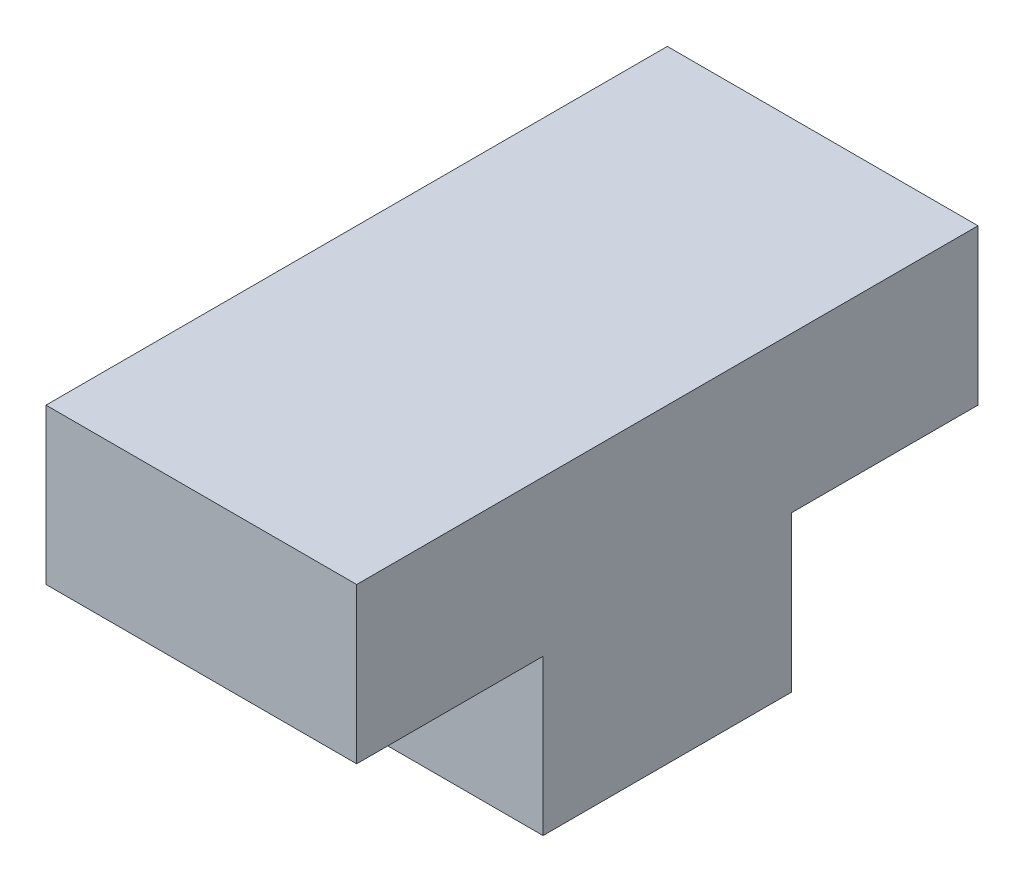
ISO-10303-21;
HEADER;
FILE_DESCRIPTION(('STEP AP214'),'2;1');
FILE_NAME('part.step','',(''),(''),'','','');
FILE_SCHEMA(('AUTOMOTIVE_DESIGN { 1 0 10303 214 1 1 1 1 }'));
ENDSEC;
DATA;
#1=APPLICATION_CONTEXT('core data for automotive mechanical design processes');
#2=APPLICATION_PROTOCOL_DEFINITION('international standard','automotive_design',2000,#1);
#3=PRODUCT_CONTEXT('',#1,'mechanical');
#4=PRODUCT('Part','Part','',(#3));
#5=PRODUCT_RELATED_PRODUCT_CATEGORY('part','',(#4));
#6=PRODUCT_DEFINITION_FORMATION('','',#4);
#7=PRODUCT_DEFINITION_CONTEXT('part definition',#1,'design');
#8=PRODUCT_DEFINITION('design','',#6,#7);
#9=PRODUCT_DEFINITION_SHAPE('','',#8);
#10=(LENGTH_UNIT() NAMED_UNIT(*) SI_UNIT(.MILLI.,.METRE.));
#11=(NAMED_UNIT(*) PLANE_ANGLE_UNIT() SI_UNIT($,.RADIAN.));
#12=(NAMED_UNIT(*) SI_UNIT($,.STERADIAN.) SOLID_ANGLE_UNIT());
#13=UNCERTAINTY_MEASURE_WITH_UNIT(LENGTH_MEASURE(1.E-05),#10,'distance_accuracy_value','');
#14=(GEOMETRIC_REPRESENTATION_CONTEXT(3) GLOBAL_UNCERTAINTY_ASSIGNED_CONTEXT((#13)) GLOBAL_UNIT_ASSIGNED_CONTEXT((#10,
#11,#12)) REPRESENTATION_CONTEXT('',''));
#15=CARTESIAN_POINT('',(0.,0.,0.));
#16=DIRECTION('',(0.,0.,1.));
#17=DIRECTION('',(1.,0.,0.));
#18=AXIS2_PLACEMENT_3D('',#15,#16,#17);
#19=CARTESIAN_POINT('',(10.,0.,-4.));
#20=DIRECTION('',(0.,0.,1.));
#21=DIRECTION('',(1.,0.,0.));
#22=AXIS2_PLACEMENT_3D('',#19,#20,#21);
#23=PLANE('',#22);
#24=DIRECTION('',(0.,1.,0.));
#25=VECTOR('',#24,1.);
#26=CARTESIAN_POINT('',(0.,0.,-4.));
#27=LINE('',#26,#25);
#28=CARTESIAN_POINT('',(0.,0.,-4.));
#29=VERTEX_POINT('',#28);
#30=CARTESIAN_POINT('',(0.,5.,-4.));
#31=VERTEX_POINT('',#30);
#32=EDGE_CURVE('E139',#29,#31,#27,.T.);
#33=ORIENTED_EDGE('',*,*,#32,.T.);
#34=DIRECTION('',(-1.,0.,0.));
#35=VECTOR('',#34,1.);
#36=CARTESIAN_POINT('',(10.,5.,-4.));
#37=LINE('',#36,#35);
#38=CARTESIAN_POINT('',(10.,5.,-4.));
#39=VERTEX_POINT('',#38);
#40=EDGE_CURVE('E11',#39,#31,#37,.T.);
#41=ORIENTED_EDGE('',*,*,#40,.F.);
#42=DIRECTION('',(0.,1.,0.));
#43=VECTOR('',#42,1.);
#44=CARTESIAN_POINT('',(10.,0.,-4.));
#45=LINE('',#44,#43);
#46=CARTESIAN_POINT('',(10.,0.,-4.));
#47=VERTEX_POINT('',#46);
#48=EDGE_CURVE('E153',#47,#39,#45,.T.);
#49=ORIENTED_EDGE('',*,*,#48,.F.);
#50=DIRECTION('',(-1.,0.,0.));
#51=VECTOR('',#50,1.);
#52=CARTESIAN_POINT('',(10.,0.,-4.));
#53=LINE('',#52,#51);
#54=EDGE_CURVE('E135',#47,#29,#53,.T.);
#55=ORIENTED_EDGE('',*,*,#54,.T.);
#56=EDGE_LOOP('',(#33,#41,#49,#55));
#57=FACE_BOUND('',#56,.T.);
#58=ADVANCED_FACE('F43',(#57),#23,.F.);
#59=CARTESIAN_POINT('',(10.,5.,-4.));
#60=DIRECTION('',(0.,1.,0.));
#61=DIRECTION('',(0.,0.,1.));
#62=AXIS2_PLACEMENT_3D('',#59,#60,#61);
#63=PLANE('',#62);
#64=DIRECTION('',(0.,0.,-1.));
#65=VECTOR('',#64,1.);
#66=CARTESIAN_POINT('',(0.,5.,-4.));
#67=LINE('',#66,#65);
#68=CARTESIAN_POINT('',(0.,5.,-10.));
#69=VERTEX_POINT('',#68);
#70=EDGE_CURVE('E142',#31,#69,#67,.T.);
#71=ORIENTED_EDGE('',*,*,#70,.T.);
#72=DIRECTION('',(-1.,0.,0.));
#73=VECTOR('',#72,1.);
#74=CARTESIAN_POINT('',(10.,5.,-10.));
#75=LINE('',#74,#73);
#76=CARTESIAN_POINT('',(10.,5.,-10.));
#77=VERTEX_POINT('',#76);
#78=EDGE_CURVE('E51',#77,#69,#75,.T.);
#79=ORIENTED_EDGE('',*,*,#78,.F.);
#80=DIRECTION('',(0.,0.,-1.));
#81=VECTOR('',#80,1.);
#82=CARTESIAN_POINT('',(10.,5.,-4.));
#83=LINE('',#82,#81);
#84=EDGE_CURVE('E102',#39,#77,#83,.T.);
#85=ORIENTED_EDGE('',*,*,#84,.F.);
#86=ORIENTED_EDGE('',*,*,#40,.T.);
#87=EDGE_LOOP('',(#71,#79,#85,#86));
#88=FACE_BOUND('',#87,.T.);
#89=ADVANCED_FACE('F188',(#88),#63,.F.);
#90=CARTESIAN_POINT('',(10.,5.,-10.));
#91=DIRECTION('',(0.,0.,1.));
#92=DIRECTION('',(1.,0.,0.));
#93=AXIS2_PLACEMENT_3D('',#90,#91,#92);
#94=PLANE('',#93);
#95=DIRECTION('',(0.,1.,0.));
#96=VECTOR('',#95,1.);
#97=CARTESIAN_POINT('',(0.,5.,-10.));
#98=LINE('',#97,#96);
#99=CARTESIAN_POINT('',(0.,10.,-10.));
#100=VERTEX_POINT('',#99);
#101=EDGE_CURVE('E144',#69,#100,#98,.T.);
#102=ORIENTED_EDGE('',*,*,#101,.T.);
#103=DIRECTION('',(-1.,0.,0.));
#104=VECTOR('',#103,1.);
#105=CARTESIAN_POINT('',(10.,10.,-10.));
#106=LINE('',#105,#104);
#107=CARTESIAN_POINT('',(10.,10.,-10.));
#108=VERTEX_POINT('',#107);
#109=EDGE_CURVE('E160',#108,#100,#106,.T.);
#110=ORIENTED_EDGE('',*,*,#109,.F.);
#111=DIRECTION('',(0.,1.,0.));
#112=VECTOR('',#111,1.);
#113=CARTESIAN_POINT('',(10.,5.,-10.));
#114=LINE('',#113,#112);
#115=EDGE_CURVE('E168',#77,#108,#114,.T.);
#116=ORIENTED_EDGE('',*,*,#115,.F.);
#117=ORIENTED_EDGE('',*,*,#78,.T.);
#118=EDGE_LOOP('',(#102,#110,#116,#117));
#119=FACE_BOUND('',#118,.T.);
#120=ADVANCED_FACE('F166',(#119),#94,.F.);
#121=CARTESIAN_POINT('',(10.,10.,-10.));
#122=DIRECTION('',(0.,-1.,0.));
#123=DIRECTION('',(0.,0.,-1.));
#124=AXIS2_PLACEMENT_3D('',#121,#122,#123);
#125=PLANE('',#124);
#126=DIRECTION('',(0.,0.,1.));
#127=VECTOR('',#126,1.);
#128=CARTESIAN_POINT('',(0.,10.,-10.));
#129=LINE('',#128,#127);
#130=CARTESIAN_POINT('',(0.,10.,10.));
#131=VERTEX_POINT('',#130);
#132=EDGE_CURVE('E146',#100,#131,#129,.T.);
#133=ORIENTED_EDGE('',*,*,#132,.T.);
#134=DIRECTION('',(-1.,0.,0.));
#135=VECTOR('',#134,1.);
#136=CARTESIAN_POINT('',(10.,10.,10.));
#137=LINE('',#136,#135);
#138=CARTESIAN_POINT('',(10.,10.,10.));
#139=VERTEX_POINT('',#138);
#140=EDGE_CURVE('E157',#139,#131,#137,.T.);
#141=ORIENTED_EDGE('',*,*,#140,.F.);
#142=DIRECTION('',(0.,0.,1.));
#143=VECTOR('',#142,1.);
#144=CARTESIAN_POINT('',(10.,10.,-10.));
#145=LINE('',#144,#143);
#146=EDGE_CURVE('E180',#108,#139,#145,.T.);
#147=ORIENTED_EDGE('',*,*,#146,.F.);
#148=ORIENTED_EDGE('',*,*,#109,.T.);
#149=EDGE_LOOP('',(#133,#141,#147,#148));
#150=FACE_BOUND('',#149,.T.);
#151=ADVANCED_FACE('F176',(#150),#125,.F.);
#152=CARTESIAN_POINT('',(10.,5.,10.));
#153=DIRECTION('',(0.,0.,-1.));
#154=DIRECTION('',(-1.,0.,0.));
#155=AXIS2_PLACEMENT_3D('',#152,#153,#154);
#156=PLANE('',#155);
#157=DIRECTION('',(0.,-1.,0.));
#158=VECTOR('',#157,1.);
#159=CARTESIAN_POINT('',(0.,5.,10.));
#160=LINE('',#159,#158);
#161=CARTESIAN_POINT('',(0.,5.,10.));
#162=VERTEX_POINT('',#161);
#163=EDGE_CURVE('E148',#131,#162,#160,.T.);
#164=ORIENTED_EDGE('',*,*,#163,.T.);
#165=DIRECTION('',(-1.,0.,0.));
#166=VECTOR('',#165,1.);
#167=CARTESIAN_POINT('',(10.,5.,10.));
#168=LINE('',#167,#166);
#169=CARTESIAN_POINT('',(10.,5.,10.));
#170=VERTEX_POINT('',#169);
#171=EDGE_CURVE('E130',#170,#162,#168,.T.);
#172=ORIENTED_EDGE('',*,*,#171,.F.);
#173=DIRECTION('',(0.,-1.,0.));
#174=VECTOR('',#173,1.);
#175=CARTESIAN_POINT('',(10.,5.,10.));
#176=LINE('',#175,#174);
#177=EDGE_CURVE('E121',#139,#170,#176,.T.);
#178=ORIENTED_EDGE('',*,*,#177,.F.);
#179=ORIENTED_EDGE('',*,*,#140,.T.);
#180=EDGE_LOOP('',(#164,#172,#178,#179));
#181=FACE_BOUND('',#180,.T.);
#182=ADVANCED_FACE('F179',(#181),#156,.F.);
#183=CARTESIAN_POINT('',(10.,5.,4.));
#184=DIRECTION('',(0.,1.,0.));
#185=DIRECTION('',(0.,0.,1.));
#186=AXIS2_PLACEMENT_3D('',#183,#184,#185);
#187=PLANE('',#186);
#188=DIRECTION('',(0.,0.,-1.));
#189=VECTOR('',#188,1.);
#190=CARTESIAN_POINT('',(0.,5.,4.));
#191=LINE('',#190,#189);
#192=CARTESIAN_POINT('',(0.,5.,4.));
#193=VERTEX_POINT('',#192);
#194=EDGE_CURVE('E129',#162,#193,#191,.T.);
#195=ORIENTED_EDGE('',*,*,#194,.T.);
#196=DIRECTION('',(-1.,0.,0.));
#197=VECTOR('',#196,1.);
#198=CARTESIAN_POINT('',(10.,5.,4.));
#199=LINE('',#198,#197);
#200=CARTESIAN_POINT('',(10.,5.,4.));
#201=VERTEX_POINT('',#200);
#202=EDGE_CURVE('E126',#201,#193,#199,.T.);
#203=ORIENTED_EDGE('',*,*,#202,.F.);
#204=DIRECTION('',(0.,0.,-1.));
#205=VECTOR('',#204,1.);
#206=CARTESIAN_POINT('',(10.,5.,4.));
#207=LINE('',#206,#205);
#208=EDGE_CURVE('E115',#170,#201,#207,.T.);
#209=ORIENTED_EDGE('',*,*,#208,.F.);
#210=ORIENTED_EDGE('',*,*,#171,.T.);
#211=EDGE_LOOP('',(#195,#203,#209,#210));
#212=FACE_BOUND('',#211,.T.);
#213=ADVANCED_FACE('F127',(#212),#187,.F.);
#214=CARTESIAN_POINT('',(10.,0.,4.));
#215=DIRECTION('',(0.,0.,-1.));
#216=DIRECTION('',(-1.,0.,0.));
#217=AXIS2_PLACEMENT_3D('',#214,#215,#216);
#218=PLANE('',#217);
#219=DIRECTION('',(0.,-1.,0.));
#220=VECTOR('',#219,1.);
#221=CARTESIAN_POINT('',(0.,0.,4.));
#222=LINE('',#221,#220);
#223=CARTESIAN_POINT('',(0.,0.,4.));
#224=VERTEX_POINT('',#223);
#225=EDGE_CURVE('E88',#193,#224,#222,.T.);
#226=ORIENTED_EDGE('',*,*,#225,.T.);
#227=DIRECTION('',(-1.,0.,0.));
#228=VECTOR('',#227,1.);
#229=CARTESIAN_POINT('',(10.,0.,4.));
#230=LINE('',#229,#228);
#231=CARTESIAN_POINT('',(10.,0.,4.));
#232=VERTEX_POINT('',#231);
#233=EDGE_CURVE('E131',#232,#224,#230,.T.);
#234=ORIENTED_EDGE('',*,*,#233,.F.);
#235=DIRECTION('',(0.,-1.,0.));
#236=VECTOR('',#235,1.);
#237=CARTESIAN_POINT('',(10.,0.,4.));
#238=LINE('',#237,#236);
#239=EDGE_CURVE('E119',#201,#232,#238,.T.);
#240=ORIENTED_EDGE('',*,*,#239,.F.);
#241=ORIENTED_EDGE('',*,*,#202,.T.);
#242=EDGE_LOOP('',(#226,#234,#240,#241));
#243=FACE_BOUND('',#242,.T.);
#244=ADVANCED_FACE('F133',(#243),#218,.F.);
#245=CARTESIAN_POINT('',(10.,0.,4.));
#246=DIRECTION('',(0.,1.,0.));
#247=DIRECTION('',(0.,0.,1.));
#248=AXIS2_PLACEMENT_3D('',#245,#246,#247);
#249=PLANE('',#248);
#250=DIRECTION('',(0.,0.,-1.));
#251=VECTOR('',#250,1.);
#252=CARTESIAN_POINT('',(0.,0.,4.));
#253=LINE('',#252,#251);
#254=EDGE_CURVE('E94',#224,#29,#253,.T.);
#255=ORIENTED_EDGE('',*,*,#254,.T.);
#256=ORIENTED_EDGE('',*,*,#54,.F.);
#257=DIRECTION('',(0.,0.,-1.));
#258=VECTOR('',#257,1.);
#259=CARTESIAN_POINT('',(10.,0.,4.));
#260=LINE('',#259,#258);
#261=EDGE_CURVE('E59',#232,#47,#260,.T.);
#262=ORIENTED_EDGE('',*,*,#261,.F.);
#263=ORIENTED_EDGE('',*,*,#233,.T.);
#264=EDGE_LOOP('',(#255,#256,#262,#263));
#265=FACE_BOUND('',#264,.T.);
#266=ADVANCED_FACE('F204',(#265),#249,.F.);
#267=CARTESIAN_POINT('',(10.,0.,0.));
#268=DIRECTION('',(-1.,0.,0.));
#269=DIRECTION('',(0.,0.,1.));
#270=AXIS2_PLACEMENT_3D('',#267,#268,#269);
#271=PLANE('',#270);
#272=ORIENTED_EDGE('',*,*,#48,.T.);
#273=ORIENTED_EDGE('',*,*,#84,.T.);
#274=ORIENTED_EDGE('',*,*,#115,.T.);
#275=ORIENTED_EDGE('',*,*,#146,.T.);
#276=ORIENTED_EDGE('',*,*,#177,.T.);
#277=ORIENTED_EDGE('',*,*,#208,.T.);
#278=ORIENTED_EDGE('',*,*,#239,.T.);
#279=ORIENTED_EDGE('',*,*,#261,.T.);
#280=EDGE_LOOP('',(#272,#273,#274,#275,#276,#277,#278,#279));
#281=FACE_BOUND('',#280,.T.);
#282=ADVANCED_FACE('F117',(#281),#271,.F.);
#283=CARTESIAN_POINT('',(0.,0.,0.));
#284=DIRECTION('',(-1.,0.,0.));
#285=DIRECTION('',(0.,0.,1.));
#286=AXIS2_PLACEMENT_3D('',#283,#284,#285);
#287=PLANE('',#286);
#288=ORIENTED_EDGE('',*,*,#32,.F.);
#289=ORIENTED_EDGE('',*,*,#254,.F.);
#290=ORIENTED_EDGE('',*,*,#225,.F.);
#291=ORIENTED_EDGE('',*,*,#194,.F.);
#292=ORIENTED_EDGE('',*,*,#163,.F.);
#293=ORIENTED_EDGE('',*,*,#132,.F.);
#294=ORIENTED_EDGE('',*,*,#101,.F.);
#295=ORIENTED_EDGE('',*,*,#70,.F.);
#296=EDGE_LOOP('',(#288,#289,#290,#291,#292,#293,#294,#295));
#297=FACE_BOUND('',#296,.T.);
#298=ADVANCED_FACE('F172',(#297),#287,.T.);
#299=CLOSED_SHELL('',(#58,#89,#120,#151,#182,#213,#244,#266,#282,#298));
#300=MANIFOLD_SOLID_BREP('B2',#299);
#301=ADVANCED_BREP_SHAPE_REPRESENTATION('',(#18,#300),#14);
#302=SHAPE_DEFINITION_REPRESENTATION(#9,#301);
ENDSEC;
END-ISO-10303-21;
